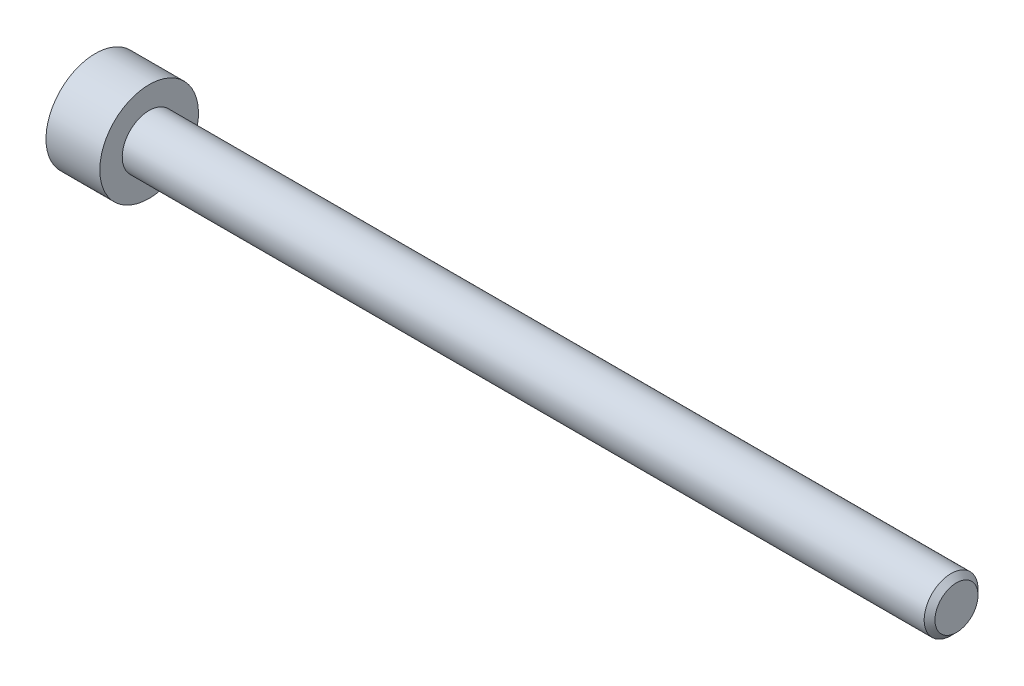
ISO-10303-21;
HEADER;
FILE_DESCRIPTION(('STEP AP214'),'2;1');
FILE_NAME('part.step','',(''),(''),'','','');
FILE_SCHEMA(('AUTOMOTIVE_DESIGN { 1 0 10303 214 1 1 1 1 }'));
ENDSEC;
DATA;
#1=APPLICATION_CONTEXT('core data for automotive mechanical design processes');
#2=APPLICATION_PROTOCOL_DEFINITION('international standard','automotive_design',2000,#1);
#3=PRODUCT_CONTEXT('',#1,'mechanical');
#4=PRODUCT('Part','Part','',(#3));
#5=PRODUCT_RELATED_PRODUCT_CATEGORY('part','',(#4));
#6=PRODUCT_DEFINITION_FORMATION('','',#4);
#7=PRODUCT_DEFINITION_CONTEXT('part definition',#1,'design');
#8=PRODUCT_DEFINITION('design','',#6,#7);
#9=PRODUCT_DEFINITION_SHAPE('','',#8);
#10=(LENGTH_UNIT() NAMED_UNIT(*) SI_UNIT(.MILLI.,.METRE.));
#11=(NAMED_UNIT(*) PLANE_ANGLE_UNIT() SI_UNIT($,.RADIAN.));
#12=(NAMED_UNIT(*) SI_UNIT($,.STERADIAN.) SOLID_ANGLE_UNIT());
#13=UNCERTAINTY_MEASURE_WITH_UNIT(LENGTH_MEASURE(1.E-05),#10,'distance_accuracy_value','');
#14=(GEOMETRIC_REPRESENTATION_CONTEXT(3) GLOBAL_UNCERTAINTY_ASSIGNED_CONTEXT((#13)) GLOBAL_UNIT_ASSIGNED_CONTEXT((#10,
#11,#12)) REPRESENTATION_CONTEXT('',''));
#15=CARTESIAN_POINT('',(0.,0.,0.));
#16=DIRECTION('',(0.,0.,1.));
#17=DIRECTION('',(1.,0.,0.));
#18=AXIS2_PLACEMENT_3D('',#15,#16,#17);
#19=CARTESIAN_POINT('',(-45.,0.,0.));
#20=DIRECTION('',(1.,0.,0.));
#21=DIRECTION('',(0.,0.,-1.));
#22=AXIS2_PLACEMENT_3D('',#19,#20,#21);
#23=CYLINDRICAL_SURFACE('',#22,1.5);
#24=CARTESIAN_POINT('',(-0.299999999999995,0.,0.));
#25=DIRECTION('',(1.,0.,0.));
#26=DIRECTION('',(0.,0.,-1.));
#27=AXIS2_PLACEMENT_3D('',#24,#25,#26);
#28=CIRCLE('',#27,1.5);
#29=CARTESIAN_POINT('',(-0.299999999999995,0.,-1.5));
#30=VERTEX_POINT('',#29);
#31=EDGE_CURVE('E45',#30,#30,#28,.F.);
#32=ORIENTED_EDGE('',*,*,#31,.T.);
#33=EDGE_LOOP('',(#32));
#34=FACE_BOUND('',#33,.T.);
#35=CARTESIAN_POINT('',(-45.,0.,0.));
#36=DIRECTION('',(-1.,0.,0.));
#37=DIRECTION('',(0.,-1.,0.));
#38=AXIS2_PLACEMENT_3D('',#35,#36,#37);
#39=CIRCLE('',#38,1.5);
#40=CARTESIAN_POINT('',(-45.,-1.50000000000001,0.));
#41=VERTEX_POINT('',#40);
#42=EDGE_CURVE('E121',#41,#41,#39,.F.);
#43=ORIENTED_EDGE('',*,*,#42,.T.);
#44=EDGE_LOOP('',(#43));
#45=FACE_BOUND('',#44,.T.);
#46=ADVANCED_FACE('F32',(#34,#45),#23,.T.);
#47=CARTESIAN_POINT('',(0.,0.,0.));
#48=DIRECTION('',(1.,0.,0.));
#49=DIRECTION('',(0.,0.,-1.));
#50=AXIS2_PLACEMENT_3D('',#47,#48,#49);
#51=PLANE('',#50);
#52=CARTESIAN_POINT('',(0.,0.,0.));
#53=DIRECTION('',(1.,0.,0.));
#54=DIRECTION('',(0.,0.,-1.));
#55=AXIS2_PLACEMENT_3D('',#52,#53,#54);
#56=CIRCLE('',#55,1.20000000000001);
#57=CARTESIAN_POINT('',(0.,0.,-1.20000000000001));
#58=VERTEX_POINT('',#57);
#59=EDGE_CURVE('E124',#58,#58,#56,.T.);
#60=ORIENTED_EDGE('',*,*,#59,.T.);
#61=EDGE_LOOP('',(#60));
#62=FACE_BOUND('',#61,.T.);
#63=ADVANCED_FACE('F134',(#62),#51,.T.);
#64=CARTESIAN_POINT('',(0.,0.,0.));
#65=DIRECTION('',(-1.,0.,0.));
#66=DIRECTION('',(0.,0.,1.));
#67=AXIS2_PLACEMENT_3D('',#64,#65,#66);
#68=CONICAL_SURFACE('',#67,1.20000000000001,0.785398163397447);
#69=ORIENTED_EDGE('',*,*,#31,.F.);
#70=EDGE_LOOP('',(#69));
#71=FACE_BOUND('',#70,.T.);
#72=ORIENTED_EDGE('',*,*,#59,.F.);
#73=EDGE_LOOP('',(#72));
#74=FACE_BOUND('',#73,.T.);
#75=ADVANCED_FACE('F34',(#71,#74),#68,.T.);
#76=CARTESIAN_POINT('',(-48.,0.,0.));
#77=DIRECTION('',(1.,0.,0.));
#78=DIRECTION('',(0.,1.,0.));
#79=AXIS2_PLACEMENT_3D('',#76,#77,#78);
#80=PLANE('',#79);
#81=CARTESIAN_POINT('',(-48.,1.83251035219191E-13,0.));
#82=DIRECTION('',(-1.,0.,0.));
#83=DIRECTION('',(0.,-1.,0.));
#84=AXIS2_PLACEMENT_3D('',#81,#82,#83);
#85=CIRCLE('',#84,1.49337567297404);
#86=CARTESIAN_POINT('',(-48.,-1.49337567297386,0.));
#87=VERTEX_POINT('',#86);
#88=EDGE_CURVE('E234',#87,#87,#85,.T.);
#89=ORIENTED_EDGE('',*,*,#88,.F.);
#90=EDGE_LOOP('',(#89));
#91=FACE_BOUND('',#90,.T.);
#92=CARTESIAN_POINT('',(-48.,0.,0.));
#93=DIRECTION('',(-1.,0.,0.));
#94=DIRECTION('',(0.,-1.,0.));
#95=AXIS2_PLACEMENT_3D('',#92,#93,#94);
#96=CIRCLE('',#95,2.75);
#97=CARTESIAN_POINT('',(-48.,-2.75,0.));
#98=VERTEX_POINT('',#97);
#99=EDGE_CURVE('E118',#98,#98,#96,.T.);
#100=ORIENTED_EDGE('',*,*,#99,.T.);
#101=EDGE_LOOP('',(#100));
#102=FACE_BOUND('',#101,.T.);
#103=ADVANCED_FACE('F133',(#91,#102),#80,.F.);
#104=CARTESIAN_POINT('',(-45.,0.,0.));
#105=DIRECTION('',(-1.,0.,0.));
#106=DIRECTION('',(0.,-1.,0.));
#107=AXIS2_PLACEMENT_3D('',#104,#105,#106);
#108=CYLINDRICAL_SURFACE('',#107,2.75);
#109=ORIENTED_EDGE('',*,*,#99,.F.);
#110=EDGE_LOOP('',(#109));
#111=FACE_BOUND('',#110,.T.);
#112=CARTESIAN_POINT('',(-45.,0.,0.));
#113=DIRECTION('',(-1.,0.,0.));
#114=DIRECTION('',(0.,-1.,0.));
#115=AXIS2_PLACEMENT_3D('',#112,#113,#114);
#116=CIRCLE('',#115,2.75);
#117=CARTESIAN_POINT('',(-45.,-2.75,0.));
#118=VERTEX_POINT('',#117);
#119=EDGE_CURVE('E115',#118,#118,#116,.T.);
#120=ORIENTED_EDGE('',*,*,#119,.T.);
#121=EDGE_LOOP('',(#120));
#122=FACE_BOUND('',#121,.T.);
#123=ADVANCED_FACE('F145',(#111,#122),#108,.T.);
#124=CARTESIAN_POINT('',(-45.,2.75,0.));
#125=DIRECTION('',(-1.,0.,0.));
#126=DIRECTION('',(0.,-1.,0.));
#127=AXIS2_PLACEMENT_3D('',#124,#125,#126);
#128=PLANE('',#127);
#129=ORIENTED_EDGE('',*,*,#42,.F.);
#130=EDGE_LOOP('',(#129));
#131=FACE_BOUND('',#130,.T.);
#132=ORIENTED_EDGE('',*,*,#119,.F.);
#133=EDGE_LOOP('',(#132));
#134=FACE_BOUND('',#133,.T.);
#135=ADVANCED_FACE('F149',(#131,#134),#128,.F.);
#136=CARTESIAN_POINT('',(-48.,1.83251035219191E-13,0.));
#137=DIRECTION('',(-1.,0.,0.));
#138=DIRECTION('',(0.,-1.,0.));
#139=AXIS2_PLACEMENT_3D('',#136,#137,#138);
#140=CONICAL_SURFACE('',#139,1.49337567297404,0.78539816339745);
#141=ORIENTED_EDGE('',*,*,#88,.T.);
#142=EDGE_LOOP('',(#141));
#143=FACE_BOUND('',#142,.T.);
#144=CARTESIAN_POINT('',(-48.4014021689884,-1.42396736984779,1.25));
#145=CARTESIAN_POINT('',(-48.375296136448,-1.38922450814756,1.25));
#146=CARTESIAN_POINT('',(-48.3494506563432,-1.35428640192978,1.25));
#147=CARTESIAN_POINT('',(-48.2983879120234,-1.28394100441944,1.25));
#148=CARTESIAN_POINT('',(-48.2731708093588,-1.24853359598558,1.25));
#149=CARTESIAN_POINT('',(-48.1982633539511,-1.14097140016101,1.25));
#150=CARTESIAN_POINT('',(-48.1497190435972,-1.06800495826732,1.25));
#151=CARTESIAN_POINT('',(-48.0545600162985,-0.915095472420174,1.25));
#152=CARTESIAN_POINT('',(-48.0082030382604,-0.83499015495432,1.25));
#153=CARTESIAN_POINT('',(-47.9235039270025,-0.670798348959241,1.25));
#154=CARTESIAN_POINT('',(-47.8851347978723,-0.58672648793699,1.25));
#155=CARTESIAN_POINT('',(-47.8381985020476,-0.460385334768531,1.25));
#156=CARTESIAN_POINT('',(-47.8247021207698,-0.419954113336438,1.25));
#157=CARTESIAN_POINT('',(-47.8009573074475,-0.338129031291116,1.25));
#158=CARTESIAN_POINT('',(-47.7907091035293,-0.296735103284009,1.25));
#159=CARTESIAN_POINT('',(-47.7741594663553,-0.213916243687624,1.25));
#160=CARTESIAN_POINT('',(-47.7677913385525,-0.172504848949173,1.25));
#161=CARTESIAN_POINT('',(-47.7591237196609,-0.0892560954740314,1.25));
#162=CARTESIAN_POINT('',(-47.7568235599982,-0.0474188078701396,1.25));
#163=CARTESIAN_POINT('',(-47.7564564105194,0.0348235296906667,1.25));
#164=CARTESIAN_POINT('',(-47.7582455485416,0.0752279922918434,1.25));
#165=CARTESIAN_POINT('',(-47.7656448035135,0.155687005579771,1.25));
#166=CARTESIAN_POINT('',(-47.7712556629701,0.195741486738124,1.25));
#167=CARTESIAN_POINT('',(-47.7860898151071,0.27588248389483,1.25));
#168=CARTESIAN_POINT('',(-47.7953738895404,0.315957579678934,1.25));
#169=CARTESIAN_POINT('',(-47.8170656964993,0.39523402739544,1.25));
#170=CARTESIAN_POINT('',(-47.8294731489785,0.434435457319079,1.25));
#171=CARTESIAN_POINT('',(-47.8734108304632,0.558570325397278,1.25));
#172=CARTESIAN_POINT('',(-47.909974414329,0.641718054006102,1.25));
#173=CARTESIAN_POINT('',(-47.9912478873066,0.804100725662246,1.25));
#174=CARTESIAN_POINT('',(-48.0359871895298,0.883320183916036,1.25));
#175=CARTESIAN_POINT('',(-48.1282652286461,1.03470895505838,1.25));
#176=CARTESIAN_POINT('',(-48.1755534388818,1.10703287925054,1.25));
#177=CARTESIAN_POINT('',(-48.2486463209253,1.21358798649207,1.25));
#178=CARTESIAN_POINT('',(-48.2732664432996,1.24864609054898,1.25));
#179=CARTESIAN_POINT('',(-48.3231552601311,1.31828380805665,1.25));
#180=CARTESIAN_POINT('',(-48.3484237758018,1.3528635494471,1.25));
#181=CARTESIAN_POINT('',(-48.3739610581169,1.38724419886404,1.25));
#182=B_SPLINE_CURVE_WITH_KNOTS('',3,(#144,#145,#146,#147,#148,#149,#150,#151,#152,#153,#154,
#155,#156,#157,#158,#159,#160,#161,#162,#163,#164,#165,#166,#167,#168,#169,#170,#171,#172,#173,
#174,#175,#176,#177,#178,#179,#180,#181),.UNSPECIFIED.,.F.,.F.,(4,2,2,2,2,2,2,2,2,2,2,2,2,2,2,2,
2,2,4),(0.,0.130370422461746,0.26077402322927,0.523571931962166,0.800995227642766,
1.07746514553939,1.2052297268728,1.33300327939669,1.45851355132212,1.58400319361986,
1.70514602294318,1.82631239533593,1.94957373840988,2.07282403363802,2.34451838945518,
2.61721016161581,2.87631588769058,3.00482945023597,3.13330794967359),.UNSPECIFIED.);
#183=CARTESIAN_POINT('',(-47.95,-0.721687836486849,1.25));
#184=VERTEX_POINT('',#183);
#185=CARTESIAN_POINT('',(-47.95,0.721687836487215,1.25));
#186=VERTEX_POINT('',#185);
#187=EDGE_CURVE('E99',#184,#186,#182,.T.);
#188=ORIENTED_EDGE('',*,*,#187,.F.);
#189=CARTESIAN_POINT('',(-47.9501154839092,-1.44349114302772,-0.000200000000000036));
#190=CARTESIAN_POINT('',(-47.9253216680551,-1.41867941875047,0.0427751670715864));
#191=CARTESIAN_POINT('',(-47.9019837344187,-1.39345276980725,0.0864690047459481));
#192=CARTESIAN_POINT('',(-47.8592520040846,-1.34201263554176,0.175565930841943));
#193=CARTESIAN_POINT('',(-47.8398819923604,-1.31579425481258,0.220977498357066));
#194=CARTESIAN_POINT('',(-47.8067004834135,-1.26292610442228,0.312547820935263));
#195=CARTESIAN_POINT('',(-47.7928055590527,-1.23628980770452,0.358683240175889));
#196=CARTESIAN_POINT('',(-47.7713972821607,-1.1824306253849,0.451970080407597));
#197=CARTESIAN_POINT('',(-47.7638679415668,-1.15520938653743,0.499118649136384));
#198=CARTESIAN_POINT('',(-47.7570744980507,-1.10829684367448,0.580373556887256));
#199=CARTESIAN_POINT('',(-47.7560685591044,-1.08866617256939,0.614374876627945));
#200=CARTESIAN_POINT('',(-47.7577614149113,-1.04943932800592,0.682317764432481));
#201=CARTESIAN_POINT('',(-47.7604610272156,-1.02984316311581,0.716259317655661));
#202=CARTESIAN_POINT('',(-47.7694089303164,-0.990839954603314,0.783814856457504));
#203=CARTESIAN_POINT('',(-47.7756605258997,-0.971433104248585,0.817428507286781));
#204=CARTESIAN_POINT('',(-47.7913756814139,-0.932943395609719,0.884094638217819));
#205=CARTESIAN_POINT('',(-47.8008406200875,-0.913860680098115,0.917146871030301));
#206=CARTESIAN_POINT('',(-47.8289313906876,-0.864986351354384,1.00179969160027));
#207=CARTESIAN_POINT('',(-47.8496701574522,-0.835502920148893,1.05286649242964));
#208=CARTESIAN_POINT('',(-47.8963871346715,-0.777690319475726,1.15300085411325));
#209=CARTESIAN_POINT('',(-47.9223482959468,-0.749357745598233,1.20207431157827));
#210=CARTESIAN_POINT('',(-47.9501154839092,-0.721572366433011,1.2502));
#211=B_SPLINE_CURVE_WITH_KNOTS('',3,(#189,#190,#191,#192,#193,#194,#195,#196,#197,#198,#199,
#200,#201,#202,#203,#204,#205,#206,#207,#208,#209,#210),.UNSPECIFIED.,.F.,.F.,(4,2,2,2,2,2,2,2,
2,2,4),(0.,0.166533409618304,0.334037607289763,0.498880396489703,0.663307919240279,
0.780963963458831,0.898645970148458,1.01643764860774,1.1342799317155,1.3214865203214,
1.50809158792574),.UNSPECIFIED.);
#212=CARTESIAN_POINT('',(-47.95,-1.44337567297388,0.));
#213=VERTEX_POINT('',#212);
#214=EDGE_CURVE('E191',#213,#184,#211,.T.);
#215=ORIENTED_EDGE('',*,*,#214,.F.);
#216=CARTESIAN_POINT('',(-47.9501154839092,-0.72157236643301,-1.2502));
#217=CARTESIAN_POINT('',(-47.9253216680551,-0.746384090710261,-1.20722483292841));
#218=CARTESIAN_POINT('',(-47.9019837344187,-0.771610739653482,-1.16353099525405));
#219=CARTESIAN_POINT('',(-47.8592520040846,-0.823050873918973,-1.07443406915806));
#220=CARTESIAN_POINT('',(-47.8398819923604,-0.849269254648151,-1.02902250164293));
#221=CARTESIAN_POINT('',(-47.8067004834135,-0.902137405038455,-0.937452179064736));
#222=CARTESIAN_POINT('',(-47.7928055590527,-0.928773701756207,-0.891316759824109));
#223=CARTESIAN_POINT('',(-47.7713972821607,-0.982632884075833,-0.798029919592401));
#224=CARTESIAN_POINT('',(-47.7638679415668,-1.0098541229233,-0.750881350863614));
#225=CARTESIAN_POINT('',(-47.7570744980507,-1.05676666578625,-0.669626443112742));
#226=CARTESIAN_POINT('',(-47.7560685591044,-1.07639733689134,-0.635625123372054));
#227=CARTESIAN_POINT('',(-47.7577614149113,-1.11562418145481,-0.567682235567517));
#228=CARTESIAN_POINT('',(-47.7604610272156,-1.13522034634492,-0.533740682344337));
#229=CARTESIAN_POINT('',(-47.7694089303164,-1.17422355485742,-0.466185143542494));
#230=CARTESIAN_POINT('',(-47.7756605258997,-1.19363040521215,-0.432571492713219));
#231=CARTESIAN_POINT('',(-47.7913756814139,-1.23212011385101,-0.365905361782181));
#232=CARTESIAN_POINT('',(-47.8008406200875,-1.25120282936262,-0.332853128969698));
#233=CARTESIAN_POINT('',(-47.8289313906876,-1.30007715810635,-0.248200308399731));
#234=CARTESIAN_POINT('',(-47.8496701574522,-1.32956058931184,-0.197133507570358));
#235=CARTESIAN_POINT('',(-47.8963871346715,-1.38737318998501,-0.0969991458867442));
#236=CARTESIAN_POINT('',(-47.9223482959468,-1.4157057638625,-0.0479256884217308));
#237=CARTESIAN_POINT('',(-47.9501154839092,-1.44349114302772,0.000199999999998401));
#238=B_SPLINE_CURVE_WITH_KNOTS('',3,(#216,#217,#218,#219,#220,#221,#222,#223,#224,#225,#226,
#227,#228,#229,#230,#231,#232,#233,#234,#235,#236,#237),.UNSPECIFIED.,.F.,.F.,(4,2,2,2,2,2,2,2,
2,2,4),(0.,0.166533409618306,0.334037607289768,0.498880396489707,0.663307919240282,
0.780963963458834,0.898645970148461,1.01643764860774,1.1342799317155,1.32148652032141,
1.50809158792573),.UNSPECIFIED.);
#239=CARTESIAN_POINT('',(-47.95,-0.721687836486849,-1.25));
#240=VERTEX_POINT('',#239);
#241=EDGE_CURVE('E186',#240,#213,#238,.T.);
#242=ORIENTED_EDGE('',*,*,#241,.F.);
#243=CARTESIAN_POINT('',(-48.4014021689884,-1.42396736984779,-1.25));
#244=CARTESIAN_POINT('',(-48.375296136448,-1.38922450814756,-1.25));
#245=CARTESIAN_POINT('',(-48.3494506563432,-1.35428640192978,-1.25));
#246=CARTESIAN_POINT('',(-48.2983879120234,-1.28394100441944,-1.25));
#247=CARTESIAN_POINT('',(-48.2731708093588,-1.24853359598558,-1.25));
#248=CARTESIAN_POINT('',(-48.1982633539511,-1.14097140016101,-1.25));
#249=CARTESIAN_POINT('',(-48.1497190435972,-1.06800495826732,-1.25));
#250=CARTESIAN_POINT('',(-48.0545600162985,-0.915095472420172,-1.25));
#251=CARTESIAN_POINT('',(-48.0082030382604,-0.834990154954318,-1.25));
#252=CARTESIAN_POINT('',(-47.9235039270025,-0.670798348959239,-1.25));
#253=CARTESIAN_POINT('',(-47.8851347978723,-0.586726487936988,-1.25));
#254=CARTESIAN_POINT('',(-47.8381985020476,-0.46038533476853,-1.25));
#255=CARTESIAN_POINT('',(-47.8247021207698,-0.419954113336437,-1.25));
#256=CARTESIAN_POINT('',(-47.8009573074475,-0.338129031291118,-1.25));
#257=CARTESIAN_POINT('',(-47.7907091035293,-0.296735103284011,-1.25));
#258=CARTESIAN_POINT('',(-47.7741594663553,-0.213916243687626,-1.25));
#259=CARTESIAN_POINT('',(-47.7677913385525,-0.172504848949175,-1.25));
#260=CARTESIAN_POINT('',(-47.7591237196609,-0.0892560954740333,-1.25));
#261=CARTESIAN_POINT('',(-47.7568235599982,-0.0474188078701414,-1.25));
#262=CARTESIAN_POINT('',(-47.7564564105194,0.0348235296906648,-1.25));
#263=CARTESIAN_POINT('',(-47.7582455485416,0.0752279922918413,-1.25));
#264=CARTESIAN_POINT('',(-47.7656448035135,0.155687005579769,-1.25));
#265=CARTESIAN_POINT('',(-47.7712556629701,0.195741486738123,-1.25));
#266=CARTESIAN_POINT('',(-47.7860898151071,0.27588248389483,-1.25));
#267=CARTESIAN_POINT('',(-47.7953738895404,0.315957579678934,-1.25));
#268=CARTESIAN_POINT('',(-47.8170656964993,0.395234027395441,-1.25));
#269=CARTESIAN_POINT('',(-47.8294731489785,0.43443545731908,-1.25));
#270=CARTESIAN_POINT('',(-47.8734108304631,0.558570325397279,-1.25));
#271=CARTESIAN_POINT('',(-47.909974414329,0.641718054006102,-1.25));
#272=CARTESIAN_POINT('',(-47.9912478873066,0.804100725662246,-1.25));
#273=CARTESIAN_POINT('',(-48.0359871895298,0.883320183916035,-1.25));
#274=CARTESIAN_POINT('',(-48.1282652286461,1.03470895505838,-1.25));
#275=CARTESIAN_POINT('',(-48.1755534388818,1.10703287925054,-1.25));
#276=CARTESIAN_POINT('',(-48.2486463209253,1.21358798649207,-1.25));
#277=CARTESIAN_POINT('',(-48.2732664432996,1.24864609054898,-1.25));
#278=CARTESIAN_POINT('',(-48.3231552601311,1.31828380805665,-1.25));
#279=CARTESIAN_POINT('',(-48.3484237758018,1.3528635494471,-1.25));
#280=CARTESIAN_POINT('',(-48.3739610581169,1.38724419886404,-1.25));
#281=B_SPLINE_CURVE_WITH_KNOTS('',3,(#243,#244,#245,#246,#247,#248,#249,#250,#251,#252,#253,
#254,#255,#256,#257,#258,#259,#260,#261,#262,#263,#264,#265,#266,#267,#268,#269,#270,#271,#272,
#273,#274,#275,#276,#277,#278,#279,#280),.UNSPECIFIED.,.F.,.F.,(4,2,2,2,2,2,2,2,2,2,2,2,2,2,2,2,
2,2,4),(0.,0.130370422461745,0.260774023229269,0.523571931962166,0.800995227642772,
1.07746514553939,1.2052297268728,1.33300327939668,1.45851355132212,1.58400319361986,
1.70514602294318,1.82631239533593,1.94957373840988,2.07282403363802,2.34451838945518,
2.61721016161581,2.87631588769058,3.00482945023597,3.13330794967358),.UNSPECIFIED.);
#282=CARTESIAN_POINT('',(-47.95,0.721687836487215,-1.25));
#283=VERTEX_POINT('',#282);
#284=EDGE_CURVE('E52',#283,#240,#281,.F.);
#285=ORIENTED_EDGE('',*,*,#284,.F.);
#286=CARTESIAN_POINT('',(-47.9501154839092,1.44349114302809,0.000200000000001351));
#287=CARTESIAN_POINT('',(-47.9253216680551,1.41867941875083,-0.042775167071587));
#288=CARTESIAN_POINT('',(-47.9019837344187,1.39345276980761,-0.0864690047459488));
#289=CARTESIAN_POINT('',(-47.8592520040846,1.34201263554212,-0.175565930841943));
#290=CARTESIAN_POINT('',(-47.8398819923604,1.31579425481295,-0.220977498357064));
#291=CARTESIAN_POINT('',(-47.8067004834135,1.26292610442264,-0.312547820935261));
#292=CARTESIAN_POINT('',(-47.7928055590527,1.23628980770489,-0.358683240175889));
#293=CARTESIAN_POINT('',(-47.7713972821607,1.18243062538526,-0.451970080407597));
#294=CARTESIAN_POINT('',(-47.7638679415668,1.15520938653779,-0.499118649136384));
#295=CARTESIAN_POINT('',(-47.7570744980507,1.10829684367485,-0.580373556887257));
#296=CARTESIAN_POINT('',(-47.7560685591044,1.08866617256976,-0.614374876627946));
#297=CARTESIAN_POINT('',(-47.7577614149113,1.04943932800629,-0.682317764432483));
#298=CARTESIAN_POINT('',(-47.7604610272156,1.02984316311617,-0.716259317655662));
#299=CARTESIAN_POINT('',(-47.7694089303164,0.990839954603678,-0.783814856457505));
#300=CARTESIAN_POINT('',(-47.7756605258997,0.97143310424895,-0.817428507286781));
#301=CARTESIAN_POINT('',(-47.7913756814139,0.932943395610084,-0.884094638217819));
#302=CARTESIAN_POINT('',(-47.8008406200875,0.913860680098479,-0.917146871030301));
#303=CARTESIAN_POINT('',(-47.8289313906876,0.864986351354748,-1.00179969160027));
#304=CARTESIAN_POINT('',(-47.8496701574522,0.835502920149256,-1.05286649242964));
#305=CARTESIAN_POINT('',(-47.8963871346715,0.77769031947609,-1.15300085411326));
#306=CARTESIAN_POINT('',(-47.9223482959468,0.749357745598599,-1.20207431157827));
#307=CARTESIAN_POINT('',(-47.9501154839092,0.721572366433378,-1.2502));
#308=B_SPLINE_CURVE_WITH_KNOTS('',3,(#286,#287,#288,#289,#290,#291,#292,#293,#294,#295,#296,
#297,#298,#299,#300,#301,#302,#303,#304,#305,#306,#307),.UNSPECIFIED.,.F.,.F.,(4,2,2,2,2,2,2,2,
2,2,4),(0.,0.166533409618306,0.334037607289766,0.498880396489705,0.663307919240282,
0.780963963458835,0.898645970148461,1.01643764860774,1.1342799317155,1.32148652032141,
1.50809158792574),.UNSPECIFIED.);
#309=CARTESIAN_POINT('',(-47.95,1.44337567297425,0.));
#310=VERTEX_POINT('',#309);
#311=EDGE_CURVE('E11',#310,#283,#308,.T.);
#312=ORIENTED_EDGE('',*,*,#311,.F.);
#313=CARTESIAN_POINT('',(-47.9501154839092,0.721572366433378,1.2502));
#314=CARTESIAN_POINT('',(-47.9253216680551,0.746384090710626,1.20722483292841));
#315=CARTESIAN_POINT('',(-47.9019837344187,0.771610739653846,1.16353099525405));
#316=CARTESIAN_POINT('',(-47.8592520040846,0.823050873919337,1.07443406915806));
#317=CARTESIAN_POINT('',(-47.8398819923604,0.849269254648517,1.02902250164293));
#318=CARTESIAN_POINT('',(-47.8067004834135,0.90213740503882,0.937452179064736));
#319=CARTESIAN_POINT('',(-47.7928055590527,0.928773701756572,0.89131675982411));
#320=CARTESIAN_POINT('',(-47.7713972821607,0.982632884076197,0.798029919592403));
#321=CARTESIAN_POINT('',(-47.7638679415668,1.00985412292367,0.750881350863615));
#322=CARTESIAN_POINT('',(-47.7570744980507,1.05676666578661,0.669626443112742));
#323=CARTESIAN_POINT('',(-47.7560685591044,1.0763973368917,0.635625123372054));
#324=CARTESIAN_POINT('',(-47.7577614149113,1.11562418145517,0.567682235567517));
#325=CARTESIAN_POINT('',(-47.7604610272156,1.13522034634529,0.533740682344337));
#326=CARTESIAN_POINT('',(-47.7694089303164,1.17422355485778,0.466185143542495));
#327=CARTESIAN_POINT('',(-47.7756605258997,1.19363040521251,0.432571492713219));
#328=CARTESIAN_POINT('',(-47.7913756814139,1.23212011385138,0.36590536178218));
#329=CARTESIAN_POINT('',(-47.8008406200875,1.25120282936298,0.332853128969698));
#330=CARTESIAN_POINT('',(-47.8289313906876,1.30007715810671,0.248200308399731));
#331=CARTESIAN_POINT('',(-47.8496701574522,1.32956058931221,0.197133507570358));
#332=CARTESIAN_POINT('',(-47.8963871346715,1.38737318998537,0.0969991458867434));
#333=CARTESIAN_POINT('',(-47.9223482959468,1.41570576386286,0.0479256884217296));
#334=CARTESIAN_POINT('',(-47.9501154839092,1.44349114302809,-0.000200000000000318));
#335=B_SPLINE_CURVE_WITH_KNOTS('',3,(#313,#314,#315,#316,#317,#318,#319,#320,#321,#322,#323,
#324,#325,#326,#327,#328,#329,#330,#331,#332,#333,#334),.UNSPECIFIED.,.F.,.F.,(4,2,2,2,2,2,2,2,
2,2,4),(0.,0.166533409618301,0.334037607289763,0.498880396489703,0.663307919240279,
0.780963963458832,0.898645970148458,1.01643764860774,1.1342799317155,1.32148652032141,
1.50809158792573),.UNSPECIFIED.);
#336=EDGE_CURVE('E90',#186,#310,#335,.T.);
#337=ORIENTED_EDGE('',*,*,#336,.F.);
#338=EDGE_LOOP('',(#188,#215,#242,#285,#312,#337));
#339=FACE_BOUND('',#338,.T.);
#340=ADVANCED_FACE('F89',(#143,#339),#140,.F.);
#341=CARTESIAN_POINT('',(-46.4,4.55402676891416E-13,0.));
#342=DIRECTION('',(-1.,0.,0.));
#343=DIRECTION('',(0.,-1.,0.));
#344=AXIS2_PLACEMENT_3D('',#341,#342,#343);
#345=PLANE('',#344);
#346=DIRECTION('',(0.,0.5,-0.866025403784439));
#347=VECTOR('',#346,1.);
#348=CARTESIAN_POINT('',(-46.4,0.72168783648721,1.25));
#349=LINE('',#348,#347);
#350=CARTESIAN_POINT('',(-46.4,0.72168783648721,1.25));
#351=VERTEX_POINT('',#350);
#352=CARTESIAN_POINT('',(-46.4,1.44337567297424,0.));
#353=VERTEX_POINT('',#352);
#354=EDGE_CURVE('E98',#351,#353,#349,.T.);
#355=ORIENTED_EDGE('',*,*,#354,.T.);
#356=DIRECTION('',(0.,-0.5,-0.866025403784439));
#357=VECTOR('',#356,1.);
#358=CARTESIAN_POINT('',(-46.4,1.44337567297424,0.));
#359=LINE('',#358,#357);
#360=CARTESIAN_POINT('',(-46.4,0.72168783648721,-1.25));
#361=VERTEX_POINT('',#360);
#362=EDGE_CURVE('E103',#353,#361,#359,.T.);
#363=ORIENTED_EDGE('',*,*,#362,.T.);
#364=DIRECTION('',(0.,-1.,0.));
#365=VECTOR('',#364,1.);
#366=CARTESIAN_POINT('',(-46.4,0.72168783648721,-1.25));
#367=LINE('',#366,#365);
#368=CARTESIAN_POINT('',(-46.4,-0.721687836486855,-1.25));
#369=VERTEX_POINT('',#368);
#370=EDGE_CURVE('E216',#361,#369,#367,.T.);
#371=ORIENTED_EDGE('',*,*,#370,.T.);
#372=DIRECTION('',(0.,-0.5,0.866025403784439));
#373=VECTOR('',#372,1.);
#374=CARTESIAN_POINT('',(-46.4,-0.721687836486855,-1.25));
#375=LINE('',#374,#373);
#376=CARTESIAN_POINT('',(-46.4,-1.44337567297389,0.));
#377=VERTEX_POINT('',#376);
#378=EDGE_CURVE('E220',#369,#377,#375,.T.);
#379=ORIENTED_EDGE('',*,*,#378,.T.);
#380=DIRECTION('',(0.,0.5,0.866025403784439));
#381=VECTOR('',#380,1.);
#382=CARTESIAN_POINT('',(-46.4,-1.44337567297389,0.));
#383=LINE('',#382,#381);
#384=CARTESIAN_POINT('',(-46.4,-0.721687836486855,1.25));
#385=VERTEX_POINT('',#384);
#386=EDGE_CURVE('E111',#377,#385,#383,.T.);
#387=ORIENTED_EDGE('',*,*,#386,.T.);
#388=DIRECTION('',(0.,1.,0.));
#389=VECTOR('',#388,1.);
#390=CARTESIAN_POINT('',(-46.4,-0.721687836486855,1.25));
#391=LINE('',#390,#389);
#392=EDGE_CURVE('E106',#385,#351,#391,.T.);
#393=ORIENTED_EDGE('',*,*,#392,.T.);
#394=EDGE_LOOP('',(#355,#363,#371,#379,#387,#393));
#395=FACE_BOUND('',#394,.T.);
#396=ADVANCED_FACE('F173',(#395),#345,.T.);
#397=CARTESIAN_POINT('',(-46.4,1.44337567297424,0.));
#398=DIRECTION('',(0.,0.866025403784439,-0.5));
#399=DIRECTION('',(0.,0.5,0.866025403784439));
#400=AXIS2_PLACEMENT_3D('',#397,#398,#399);
#401=PLANE('',#400);
#402=DIRECTION('',(-1.,0.,0.));
#403=VECTOR('',#402,1.);
#404=CARTESIAN_POINT('',(-46.4,1.44337567297424,0.));
#405=LINE('',#404,#403);
#406=EDGE_CURVE('E96',#353,#310,#405,.T.);
#407=ORIENTED_EDGE('',*,*,#406,.T.);
#408=ORIENTED_EDGE('',*,*,#311,.T.);
#409=DIRECTION('',(-1.,0.,0.));
#410=VECTOR('',#409,1.);
#411=CARTESIAN_POINT('',(-46.4,0.72168783648721,-1.25));
#412=LINE('',#411,#410);
#413=EDGE_CURVE('E105',#361,#283,#412,.T.);
#414=ORIENTED_EDGE('',*,*,#413,.F.);
#415=ORIENTED_EDGE('',*,*,#362,.F.);
#416=EDGE_LOOP('',(#407,#408,#414,#415));
#417=FACE_BOUND('',#416,.T.);
#418=ADVANCED_FACE('F101',(#417),#401,.F.);
#419=CARTESIAN_POINT('',(-46.4,0.72168783648721,-1.25));
#420=DIRECTION('',(0.,0.,-1.));
#421=DIRECTION('',(-1.,0.,0.));
#422=AXIS2_PLACEMENT_3D('',#419,#420,#421);
#423=PLANE('',#422);
#424=ORIENTED_EDGE('',*,*,#413,.T.);
#425=ORIENTED_EDGE('',*,*,#284,.T.);
#426=DIRECTION('',(-1.,0.,0.));
#427=VECTOR('',#426,1.);
#428=CARTESIAN_POINT('',(-46.4,-0.721687836486855,-1.25));
#429=LINE('',#428,#427);
#430=EDGE_CURVE('E108',#369,#240,#429,.T.);
#431=ORIENTED_EDGE('',*,*,#430,.F.);
#432=ORIENTED_EDGE('',*,*,#370,.F.);
#433=EDGE_LOOP('',(#424,#425,#431,#432));
#434=FACE_BOUND('',#433,.T.);
#435=ADVANCED_FACE('F205',(#434),#423,.F.);
#436=CARTESIAN_POINT('',(-46.4,-0.721687836486855,-1.25));
#437=DIRECTION('',(0.,-0.866025403784438,-0.5));
#438=DIRECTION('',(0.,0.5,-0.866025403784439));
#439=AXIS2_PLACEMENT_3D('',#436,#437,#438);
#440=PLANE('',#439);
#441=ORIENTED_EDGE('',*,*,#430,.T.);
#442=ORIENTED_EDGE('',*,*,#241,.T.);
#443=DIRECTION('',(-1.,0.,0.));
#444=VECTOR('',#443,1.);
#445=CARTESIAN_POINT('',(-46.4,-1.44337567297389,0.));
#446=LINE('',#445,#444);
#447=EDGE_CURVE('E230',#377,#213,#446,.T.);
#448=ORIENTED_EDGE('',*,*,#447,.F.);
#449=ORIENTED_EDGE('',*,*,#378,.F.);
#450=EDGE_LOOP('',(#441,#442,#448,#449));
#451=FACE_BOUND('',#450,.T.);
#452=ADVANCED_FACE('F200',(#451),#440,.F.);
#453=CARTESIAN_POINT('',(-46.4,-1.44337567297389,0.));
#454=DIRECTION('',(0.,-0.866025403784439,0.5));
#455=DIRECTION('',(0.,-0.5,-0.866025403784439));
#456=AXIS2_PLACEMENT_3D('',#453,#454,#455);
#457=PLANE('',#456);
#458=ORIENTED_EDGE('',*,*,#447,.T.);
#459=ORIENTED_EDGE('',*,*,#214,.T.);
#460=DIRECTION('',(-1.,0.,0.));
#461=VECTOR('',#460,1.);
#462=CARTESIAN_POINT('',(-46.4,-0.721687836486855,1.25));
#463=LINE('',#462,#461);
#464=EDGE_CURVE('E227',#385,#184,#463,.T.);
#465=ORIENTED_EDGE('',*,*,#464,.F.);
#466=ORIENTED_EDGE('',*,*,#386,.F.);
#467=EDGE_LOOP('',(#458,#459,#465,#466));
#468=FACE_BOUND('',#467,.T.);
#469=ADVANCED_FACE('F197',(#468),#457,.F.);
#470=CARTESIAN_POINT('',(-46.4,-0.721687836486855,1.25));
#471=DIRECTION('',(0.,0.,1.));
#472=DIRECTION('',(1.,0.,0.));
#473=AXIS2_PLACEMENT_3D('',#470,#471,#472);
#474=PLANE('',#473);
#475=ORIENTED_EDGE('',*,*,#464,.T.);
#476=ORIENTED_EDGE('',*,*,#187,.T.);
#477=DIRECTION('',(-1.,0.,0.));
#478=VECTOR('',#477,1.);
#479=CARTESIAN_POINT('',(-46.4,0.72168783648721,1.25));
#480=LINE('',#479,#478);
#481=EDGE_CURVE('E59',#351,#186,#480,.T.);
#482=ORIENTED_EDGE('',*,*,#481,.F.);
#483=ORIENTED_EDGE('',*,*,#392,.F.);
#484=EDGE_LOOP('',(#475,#476,#482,#483));
#485=FACE_BOUND('',#484,.T.);
#486=ADVANCED_FACE('F156',(#485),#474,.F.);
#487=CARTESIAN_POINT('',(-46.4,0.72168783648721,1.25));
#488=DIRECTION('',(0.,0.866025403784439,0.5));
#489=DIRECTION('',(0.,-0.5,0.866025403784439));
#490=AXIS2_PLACEMENT_3D('',#487,#488,#489);
#491=PLANE('',#490);
#492=ORIENTED_EDGE('',*,*,#481,.T.);
#493=ORIENTED_EDGE('',*,*,#336,.T.);
#494=ORIENTED_EDGE('',*,*,#406,.F.);
#495=ORIENTED_EDGE('',*,*,#354,.F.);
#496=EDGE_LOOP('',(#492,#493,#494,#495));
#497=FACE_BOUND('',#496,.T.);
#498=ADVANCED_FACE('F95',(#497),#491,.F.);
#499=CLOSED_SHELL('',(#46,#63,#75,#103,#123,#135,#340,#396,#418,#435,#452,#469,#486,#498));
#500=MANIFOLD_SOLID_BREP('B2',#499);
#501=ADVANCED_BREP_SHAPE_REPRESENTATION('',(#18,#500),#14);
#502=SHAPE_DEFINITION_REPRESENTATION(#9,#501);
ENDSEC;
END-ISO-10303-21;
